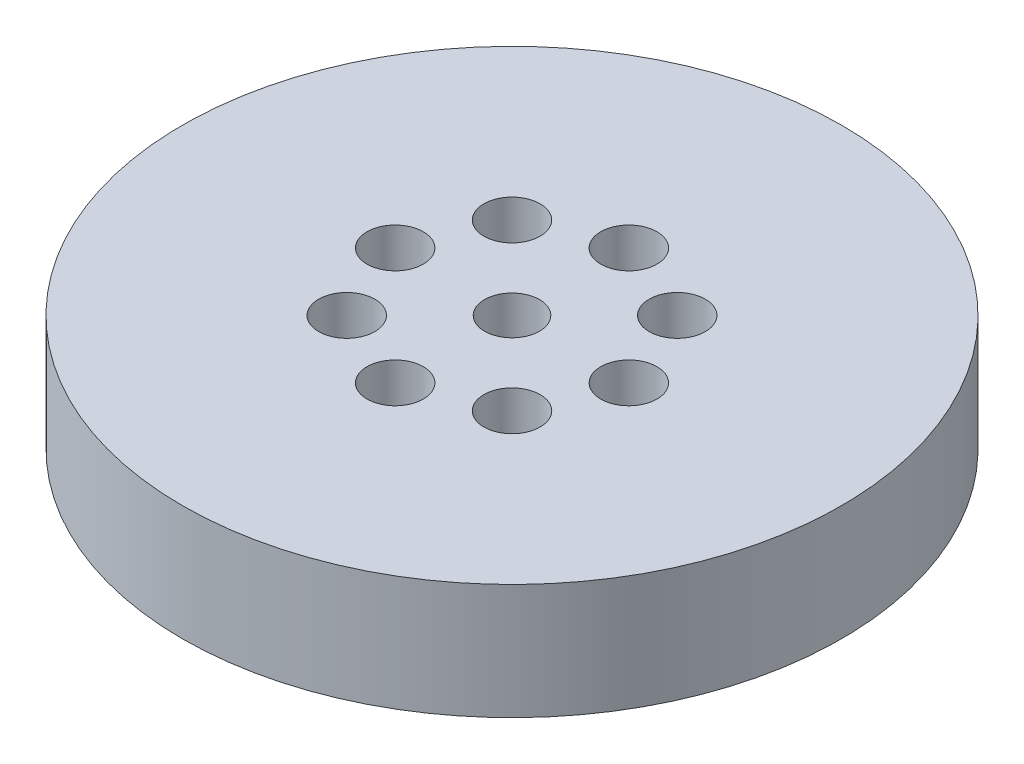
ISO-10303-21;
HEADER;
FILE_DESCRIPTION(('STEP AP214'),'2;1');
FILE_NAME('part.step','',(''),(''),'','','');
FILE_SCHEMA(('AUTOMOTIVE_DESIGN { 1 0 10303 214 1 1 1 1 }'));
ENDSEC;
DATA;
#1=APPLICATION_CONTEXT('core data for automotive mechanical design processes');
#2=APPLICATION_PROTOCOL_DEFINITION('international standard','automotive_design',2000,#1);
#3=PRODUCT_CONTEXT('',#1,'mechanical');
#4=PRODUCT('Part','Part','',(#3));
#5=PRODUCT_RELATED_PRODUCT_CATEGORY('part','',(#4));
#6=PRODUCT_DEFINITION_FORMATION('','',#4);
#7=PRODUCT_DEFINITION_CONTEXT('part definition',#1,'design');
#8=PRODUCT_DEFINITION('design','',#6,#7);
#9=PRODUCT_DEFINITION_SHAPE('','',#8);
#10=(LENGTH_UNIT() NAMED_UNIT(*) SI_UNIT(.MILLI.,.METRE.));
#11=(NAMED_UNIT(*) PLANE_ANGLE_UNIT() SI_UNIT($,.RADIAN.));
#12=(NAMED_UNIT(*) SI_UNIT($,.STERADIAN.) SOLID_ANGLE_UNIT());
#13=UNCERTAINTY_MEASURE_WITH_UNIT(LENGTH_MEASURE(1.E-05),#10,'distance_accuracy_value','');
#14=(GEOMETRIC_REPRESENTATION_CONTEXT(3) GLOBAL_UNCERTAINTY_ASSIGNED_CONTEXT((#13)) GLOBAL_UNIT_ASSIGNED_CONTEXT((#10,
#11,#12)) REPRESENTATION_CONTEXT('',''));
#15=CARTESIAN_POINT('',(0.,0.,0.));
#16=DIRECTION('',(0.,0.,1.));
#17=DIRECTION('',(1.,0.,0.));
#18=AXIS2_PLACEMENT_3D('',#15,#16,#17);
#19=CARTESIAN_POINT('',(0.,21.,0.));
#20=DIRECTION('',(0.,-1.,0.));
#21=DIRECTION('',(0.,0.,-1.));
#22=AXIS2_PLACEMENT_3D('',#19,#20,#21);
#23=CYLINDRICAL_SURFACE('',#22,60.);
#24=CARTESIAN_POINT('',(0.,21.,0.));
#25=DIRECTION('',(0.,1.,0.));
#26=DIRECTION('',(0.,0.,1.));
#27=AXIS2_PLACEMENT_3D('',#24,#25,#26);
#28=CIRCLE('',#27,60.);
#29=CARTESIAN_POINT('',(0.,21.,-60.));
#30=VERTEX_POINT('',#29);
#31=EDGE_CURVE('E10',#30,#30,#28,.T.);
#32=CARTESIAN_POINT('',(0.,0.,0.));
#33=DIRECTION('',(0.,1.,0.));
#34=DIRECTION('',(0.,0.,1.));
#35=AXIS2_PLACEMENT_3D('',#32,#33,#34);
#36=CIRCLE('',#35,60.);
#37=CARTESIAN_POINT('',(0.,0.,-60.));
#38=VERTEX_POINT('',#37);
#39=EDGE_CURVE('E37',#38,#38,#36,.T.);
#40=CARTESIAN_POINT('',(0.,21.,-60.));
#41=CARTESIAN_POINT('',(0.,20.78125,-60.));
#42=CARTESIAN_POINT('',(0.,20.5625,-60.));
#43=CARTESIAN_POINT('',(0.,20.125,-60.));
#44=CARTESIAN_POINT('',(0.,19.90625,-60.));
#45=CARTESIAN_POINT('',(0.,19.46875,-60.));
#46=CARTESIAN_POINT('',(0.,19.25,-60.));
#47=CARTESIAN_POINT('',(0.,18.8125,-60.));
#48=CARTESIAN_POINT('',(0.,18.59375,-60.));
#49=CARTESIAN_POINT('',(0.,18.15625,-60.));
#50=CARTESIAN_POINT('',(0.,17.9375,-60.));
#51=CARTESIAN_POINT('',(0.,17.5,-60.));
#52=CARTESIAN_POINT('',(0.,17.28125,-60.));
#53=CARTESIAN_POINT('',(0.,16.84375,-60.));
#54=CARTESIAN_POINT('',(0.,16.625,-60.));
#55=CARTESIAN_POINT('',(0.,16.1875,-60.));
#56=CARTESIAN_POINT('',(0.,15.96875,-60.));
#57=CARTESIAN_POINT('',(0.,15.53125,-60.));
#58=CARTESIAN_POINT('',(0.,15.3125,-60.));
#59=CARTESIAN_POINT('',(0.,14.875,-60.));
#60=CARTESIAN_POINT('',(0.,14.65625,-60.));
#61=CARTESIAN_POINT('',(0.,14.21875,-60.));
#62=CARTESIAN_POINT('',(0.,14.,-60.));
#63=CARTESIAN_POINT('',(0.,13.5625,-60.));
#64=CARTESIAN_POINT('',(0.,13.34375,-60.));
#65=CARTESIAN_POINT('',(0.,12.90625,-60.));
#66=CARTESIAN_POINT('',(0.,12.6875,-60.));
#67=CARTESIAN_POINT('',(0.,12.25,-60.));
#68=CARTESIAN_POINT('',(0.,12.03125,-60.));
#69=CARTESIAN_POINT('',(0.,11.59375,-60.));
#70=CARTESIAN_POINT('',(0.,11.375,-60.));
#71=CARTESIAN_POINT('',(0.,10.9375,-60.));
#72=CARTESIAN_POINT('',(0.,10.71875,-60.));
#73=CARTESIAN_POINT('',(0.,10.28125,-60.));
#74=CARTESIAN_POINT('',(0.,10.0625,-60.));
#75=CARTESIAN_POINT('',(0.,9.625,-60.));
#76=CARTESIAN_POINT('',(0.,9.40625,-60.));
#77=CARTESIAN_POINT('',(0.,8.96875,-60.));
#78=CARTESIAN_POINT('',(0.,8.75,-60.));
#79=CARTESIAN_POINT('',(0.,8.3125,-60.));
#80=CARTESIAN_POINT('',(0.,8.09375,-60.));
#81=CARTESIAN_POINT('',(0.,7.65625,-60.));
#82=CARTESIAN_POINT('',(0.,7.4375,-60.));
#83=CARTESIAN_POINT('',(0.,7.,-60.));
#84=CARTESIAN_POINT('',(0.,6.78125,-60.));
#85=CARTESIAN_POINT('',(0.,6.34375,-60.));
#86=CARTESIAN_POINT('',(0.,6.125,-60.));
#87=CARTESIAN_POINT('',(0.,5.6875,-60.));
#88=CARTESIAN_POINT('',(0.,5.46875,-60.));
#89=CARTESIAN_POINT('',(0.,5.03125,-60.));
#90=CARTESIAN_POINT('',(0.,4.8125,-60.));
#91=CARTESIAN_POINT('',(0.,4.375,-60.));
#92=CARTESIAN_POINT('',(0.,4.15625,-60.));
#93=CARTESIAN_POINT('',(0.,3.71875,-60.));
#94=CARTESIAN_POINT('',(0.,3.5,-60.));
#95=CARTESIAN_POINT('',(0.,3.0625,-60.));
#96=CARTESIAN_POINT('',(0.,2.84375,-60.));
#97=CARTESIAN_POINT('',(0.,2.40625,-60.));
#98=CARTESIAN_POINT('',(0.,2.1875,-60.));
#99=CARTESIAN_POINT('',(0.,1.75,-60.));
#100=CARTESIAN_POINT('',(0.,1.53125,-60.));
#101=CARTESIAN_POINT('',(0.,1.09375,-60.));
#102=CARTESIAN_POINT('',(0.,0.875000000000001,-60.));
#103=CARTESIAN_POINT('',(0.,0.4375,-60.));
#104=CARTESIAN_POINT('',(0.,0.21875,-60.));
#105=CARTESIAN_POINT('',(0.,0.,-60.));
#106=B_SPLINE_CURVE_WITH_KNOTS('',3,(#40,#41,#42,#43,#44,#45,#46,#47,#48,#49,#50,#51,#52,#53,
#54,#55,#56,#57,#58,#59,#60,#61,#62,#63,#64,#65,#66,#67,#68,#69,#70,#71,#72,#73,#74,#75,#76,#77,
#78,#79,#80,#81,#82,#83,#84,#85,#86,#87,#88,#89,#90,#91,#92,#93,#94,#95,#96,#97,#98,#99,#100,
#101,#102,#103,#104,#105),.UNSPECIFIED.,.F.,.F.,(4,2,2,2,2,2,2,2,2,2,2,2,2,2,2,2,2,2,2,2,2,2,2,
2,2,2,2,2,2,2,2,2,4),(0.,0.656250000000001,1.3125,1.96875,2.625,3.28125,3.9375,4.59375,5.25,
5.90625,6.5625,7.21875,7.875,8.53125,9.1875,9.84375,10.5,11.15625,11.8125,12.46875,13.125,
13.78125,14.4375,15.09375,15.75,16.40625,17.0625,17.71875,18.375,19.03125,19.6875,20.34375,21.),.UNSPECIFIED.);
#107=EDGE_CURVE('BSEAM40',#30,#38,#106,.T.);
#108=ORIENTED_EDGE('',*,*,#31,.F.);
#109=ORIENTED_EDGE('',*,*,#39,.T.);
#110=ORIENTED_EDGE('',*,*,#107,.T.);
#111=ORIENTED_EDGE('',*,*,#107,.F.);
#112=EDGE_LOOP('',(#108,#110,#109,#111));
#113=FACE_BOUND('',#112,.T.);
#114=ADVANCED_FACE('F40',(#113),#23,.T.);
#115=CARTESIAN_POINT('',(0.,21.,0.));
#116=DIRECTION('',(0.,1.,0.));
#117=DIRECTION('',(0.,0.,1.));
#118=AXIS2_PLACEMENT_3D('',#115,#116,#117);
#119=PLANE('',#118);
#120=CARTESIAN_POINT('',(0.,21.,21.2727506876326));
#121=DIRECTION('',(0.,1.,0.));
#122=DIRECTION('',(1.,0.,0.));
#123=AXIS2_PLACEMENT_3D('',#120,#121,#122);
#124=CIRCLE('',#123,5.11864766276758);
#125=CARTESIAN_POINT('',(5.11864766276766,21.,21.2727506876325));
#126=VERTEX_POINT('',#125);
#127=EDGE_CURVE('E88',#126,#126,#124,.T.);
#128=ORIENTED_EDGE('',*,*,#127,.F.);
#129=EDGE_LOOP('',(#128));
#130=FACE_BOUND('',#129,.T.);
#131=CARTESIAN_POINT('',(15.0421062657159,21.,15.0421062657157));
#132=DIRECTION('',(0.,1.,0.));
#133=DIRECTION('',(0.707106781186544,0.,-0.707106781186551));
#134=AXIS2_PLACEMENT_3D('',#131,#132,#133);
#135=CIRCLE('',#134,5.11864766276758);
#136=CARTESIAN_POINT('',(18.6615367385635,21.,11.422675792868));
#137=VERTEX_POINT('',#136);
#138=EDGE_CURVE('E79',#137,#137,#135,.T.);
#139=ORIENTED_EDGE('',*,*,#138,.F.);
#140=EDGE_LOOP('',(#139));
#141=FACE_BOUND('',#140,.T.);
#142=CARTESIAN_POINT('',(21.2727506876326,21.,0.));
#143=DIRECTION('',(0.,1.,0.));
#144=DIRECTION('',(0.,0.,-1.));
#145=AXIS2_PLACEMENT_3D('',#142,#143,#144);
#146=CIRCLE('',#145,5.11864766276758);
#147=CARTESIAN_POINT('',(21.2727506876326,21.,-5.11864766276758));
#148=VERTEX_POINT('',#147);
#149=EDGE_CURVE('E74',#148,#148,#146,.T.);
#150=ORIENTED_EDGE('',*,*,#149,.F.);
#151=EDGE_LOOP('',(#150));
#152=FACE_BOUND('',#151,.T.);
#153=CARTESIAN_POINT('',(15.0421062657156,21.,-15.0421062657159));
#154=DIRECTION('',(0.,1.,0.));
#155=DIRECTION('',(-0.707106781186554,0.,-0.707106781186541));
#156=AXIS2_PLACEMENT_3D('',#153,#154,#155);
#157=CIRCLE('',#156,5.11864766276758);
#158=CARTESIAN_POINT('',(11.422675792868,21.,-18.6615367385635));
#159=VERTEX_POINT('',#158);
#160=EDGE_CURVE('E70',#159,#159,#157,.T.);
#161=ORIENTED_EDGE('',*,*,#160,.F.);
#162=EDGE_LOOP('',(#161));
#163=FACE_BOUND('',#162,.T.);
#164=CARTESIAN_POINT('',(-2.22820236155195E-13,21.,-21.2727506876326));
#165=DIRECTION('',(0.,1.,0.));
#166=DIRECTION('',(-1.,0.,0.));
#167=AXIS2_PLACEMENT_3D('',#164,#165,#166);
#168=CIRCLE('',#167,5.11864766276758);
#169=CARTESIAN_POINT('',(-5.11864766276781,21.,-21.2727506876325));
#170=VERTEX_POINT('',#169);
#171=EDGE_CURVE('E100',#170,#170,#168,.T.);
#172=ORIENTED_EDGE('',*,*,#171,.F.);
#173=EDGE_LOOP('',(#172));
#174=FACE_BOUND('',#173,.T.);
#175=CARTESIAN_POINT('',(-15.042106265716,21.,-15.0421062657156));
#176=DIRECTION('',(0.,1.,0.));
#177=DIRECTION('',(-0.707106781186539,0.,0.707106781186556));
#178=AXIS2_PLACEMENT_3D('',#175,#176,#177);
#179=CIRCLE('',#178,5.11864766276758);
#180=CARTESIAN_POINT('',(-18.6615367385635,21.,-11.4226757928679));
#181=VERTEX_POINT('',#180);
#182=EDGE_CURVE('E93',#181,#181,#179,.T.);
#183=ORIENTED_EDGE('',*,*,#182,.F.);
#184=EDGE_LOOP('',(#183));
#185=FACE_BOUND('',#184,.T.);
#186=CARTESIAN_POINT('',(-15.0421062657158,21.,15.0421062657158));
#187=DIRECTION('',(0.,1.,0.));
#188=DIRECTION('',(0.707106781186549,0.,0.707106781186546));
#189=AXIS2_PLACEMENT_3D('',#186,#187,#188);
#190=CIRCLE('',#189,5.11864766276758);
#191=CARTESIAN_POINT('',(-11.4226757928681,21.,18.6615367385634));
#192=VERTEX_POINT('',#191);
#193=EDGE_CURVE('E61',#192,#192,#190,.T.);
#194=ORIENTED_EDGE('',*,*,#193,.F.);
#195=EDGE_LOOP('',(#194));
#196=FACE_BOUND('',#195,.T.);
#197=CARTESIAN_POINT('',(-21.2727506876326,21.,0.));
#198=DIRECTION('',(0.,1.,0.));
#199=DIRECTION('',(0.,0.,1.));
#200=AXIS2_PLACEMENT_3D('',#197,#198,#199);
#201=CIRCLE('',#200,5.11864766276758);
#202=CARTESIAN_POINT('',(-21.2727506876326,21.,5.11864766276758));
#203=VERTEX_POINT('',#202);
#204=EDGE_CURVE('E54',#203,#203,#201,.T.);
#205=ORIENTED_EDGE('',*,*,#204,.F.);
#206=EDGE_LOOP('',(#205));
#207=FACE_BOUND('',#206,.T.);
#208=CARTESIAN_POINT('',(0.,21.,0.));
#209=DIRECTION('',(0.,1.,0.));
#210=DIRECTION('',(0.,0.,1.));
#211=AXIS2_PLACEMENT_3D('',#208,#209,#210);
#212=CIRCLE('',#211,5.);
#213=CARTESIAN_POINT('',(0.,21.,-5.));
#214=VERTEX_POINT('',#213);
#215=EDGE_CURVE('E50',#214,#214,#212,.T.);
#216=ORIENTED_EDGE('',*,*,#215,.F.);
#217=EDGE_LOOP('',(#216));
#218=FACE_BOUND('',#217,.T.);
#219=ORIENTED_EDGE('',*,*,#31,.T.);
#220=EDGE_LOOP('',(#219));
#221=FACE_BOUND('',#220,.T.);
#222=ADVANCED_FACE('F115',(#130,#141,#152,#163,#174,#185,#196,#207,#218,#221),#119,.T.);
#223=CARTESIAN_POINT('',(0.,0.,0.));
#224=DIRECTION('',(0.,1.,0.));
#225=DIRECTION('',(0.,0.,1.));
#226=AXIS2_PLACEMENT_3D('',#223,#224,#225);
#227=PLANE('',#226);
#228=CARTESIAN_POINT('',(0.,0.,0.));
#229=DIRECTION('',(0.,1.,0.));
#230=DIRECTION('',(0.,0.,1.));
#231=AXIS2_PLACEMENT_3D('',#228,#229,#230);
#232=CIRCLE('',#231,5.);
#233=CARTESIAN_POINT('',(0.,0.,-5.));
#234=VERTEX_POINT('',#233);
#235=EDGE_CURVE('E47',#234,#234,#232,.T.);
#236=ORIENTED_EDGE('',*,*,#235,.T.);
#237=EDGE_LOOP('',(#236));
#238=FACE_BOUND('',#237,.T.);
#239=ORIENTED_EDGE('',*,*,#39,.F.);
#240=EDGE_LOOP('',(#239));
#241=FACE_BOUND('',#240,.T.);
#242=ADVANCED_FACE('F113',(#238,#241),#227,.F.);
#243=CARTESIAN_POINT('',(0.,21.,0.));
#244=DIRECTION('',(0.,-1.,0.));
#245=DIRECTION('',(0.,0.,-1.));
#246=AXIS2_PLACEMENT_3D('',#243,#244,#245);
#247=CYLINDRICAL_SURFACE('',#246,5.);
#248=CARTESIAN_POINT('',(0.,21.,-5.));
#249=CARTESIAN_POINT('',(0.,20.78125,-5.));
#250=CARTESIAN_POINT('',(0.,20.5625,-5.));
#251=CARTESIAN_POINT('',(0.,20.125,-5.));
#252=CARTESIAN_POINT('',(0.,19.90625,-5.));
#253=CARTESIAN_POINT('',(0.,19.46875,-5.));
#254=CARTESIAN_POINT('',(0.,19.25,-5.));
#255=CARTESIAN_POINT('',(0.,18.8125,-5.));
#256=CARTESIAN_POINT('',(0.,18.59375,-5.));
#257=CARTESIAN_POINT('',(0.,18.15625,-5.));
#258=CARTESIAN_POINT('',(0.,17.9375,-5.));
#259=CARTESIAN_POINT('',(0.,17.5,-5.));
#260=CARTESIAN_POINT('',(0.,17.28125,-5.));
#261=CARTESIAN_POINT('',(0.,16.84375,-5.));
#262=CARTESIAN_POINT('',(0.,16.625,-5.));
#263=CARTESIAN_POINT('',(0.,16.1875,-5.));
#264=CARTESIAN_POINT('',(0.,15.96875,-5.));
#265=CARTESIAN_POINT('',(0.,15.53125,-5.));
#266=CARTESIAN_POINT('',(0.,15.3125,-5.));
#267=CARTESIAN_POINT('',(0.,14.875,-5.));
#268=CARTESIAN_POINT('',(0.,14.65625,-5.));
#269=CARTESIAN_POINT('',(0.,14.21875,-5.));
#270=CARTESIAN_POINT('',(0.,14.,-5.));
#271=CARTESIAN_POINT('',(0.,13.5625,-5.));
#272=CARTESIAN_POINT('',(0.,13.34375,-5.));
#273=CARTESIAN_POINT('',(0.,12.90625,-5.));
#274=CARTESIAN_POINT('',(0.,12.6875,-5.));
#275=CARTESIAN_POINT('',(0.,12.25,-5.));
#276=CARTESIAN_POINT('',(0.,12.03125,-5.));
#277=CARTESIAN_POINT('',(0.,11.59375,-5.));
#278=CARTESIAN_POINT('',(0.,11.375,-5.));
#279=CARTESIAN_POINT('',(0.,10.9375,-5.));
#280=CARTESIAN_POINT('',(0.,10.71875,-5.));
#281=CARTESIAN_POINT('',(0.,10.28125,-5.));
#282=CARTESIAN_POINT('',(0.,10.0625,-5.));
#283=CARTESIAN_POINT('',(0.,9.625,-5.));
#284=CARTESIAN_POINT('',(0.,9.40625,-5.));
#285=CARTESIAN_POINT('',(0.,8.96875,-5.));
#286=CARTESIAN_POINT('',(0.,8.75,-5.));
#287=CARTESIAN_POINT('',(0.,8.3125,-5.));
#288=CARTESIAN_POINT('',(0.,8.09375,-5.));
#289=CARTESIAN_POINT('',(0.,7.65625,-5.));
#290=CARTESIAN_POINT('',(0.,7.4375,-5.));
#291=CARTESIAN_POINT('',(0.,7.,-5.));
#292=CARTESIAN_POINT('',(0.,6.78125,-5.));
#293=CARTESIAN_POINT('',(0.,6.34375,-5.));
#294=CARTESIAN_POINT('',(0.,6.125,-5.));
#295=CARTESIAN_POINT('',(0.,5.6875,-5.));
#296=CARTESIAN_POINT('',(0.,5.46875,-5.));
#297=CARTESIAN_POINT('',(0.,5.03125,-5.));
#298=CARTESIAN_POINT('',(0.,4.8125,-5.));
#299=CARTESIAN_POINT('',(0.,4.375,-5.));
#300=CARTESIAN_POINT('',(0.,4.15625,-5.));
#301=CARTESIAN_POINT('',(0.,3.71875,-5.));
#302=CARTESIAN_POINT('',(0.,3.5,-5.));
#303=CARTESIAN_POINT('',(0.,3.0625,-5.));
#304=CARTESIAN_POINT('',(0.,2.84375,-5.));
#305=CARTESIAN_POINT('',(0.,2.40625,-5.));
#306=CARTESIAN_POINT('',(0.,2.1875,-5.));
#307=CARTESIAN_POINT('',(0.,1.75,-5.));
#308=CARTESIAN_POINT('',(0.,1.53125,-5.));
#309=CARTESIAN_POINT('',(0.,1.09375,-5.));
#310=CARTESIAN_POINT('',(0.,0.875000000000001,-5.));
#311=CARTESIAN_POINT('',(0.,0.4375,-5.));
#312=CARTESIAN_POINT('',(0.,0.21875,-5.));
#313=CARTESIAN_POINT('',(0.,0.,-5.));
#314=B_SPLINE_CURVE_WITH_KNOTS('',3,(#248,#249,#250,#251,#252,#253,#254,#255,#256,#257,#258,
#259,#260,#261,#262,#263,#264,#265,#266,#267,#268,#269,#270,#271,#272,#273,#274,#275,#276,#277,
#278,#279,#280,#281,#282,#283,#284,#285,#286,#287,#288,#289,#290,#291,#292,#293,#294,#295,#296,
#297,#298,#299,#300,#301,#302,#303,#304,#305,#306,#307,#308,#309,#310,#311,#312,#313),
.UNSPECIFIED.,.F.,.F.,(4,2,2,2,2,2,2,2,2,2,2,2,2,2,2,2,2,2,2,2,2,2,2,2,2,2,2,2,2,2,2,2,4),(0.,
0.656250000000001,1.3125,1.96875,2.625,3.28125,3.9375,4.59375,5.25,5.90625,6.5625,7.21875,7.875,
8.53125,9.1875,9.84375,10.5,11.15625,11.8125,12.46875,13.125,13.78125,14.4375,15.09375,15.75,
16.40625,17.0625,17.71875,18.375,19.03125,19.6875,20.34375,21.),.UNSPECIFIED.);
#315=EDGE_CURVE('BSEAM127',#214,#234,#314,.T.);
#316=ORIENTED_EDGE('',*,*,#215,.T.);
#317=ORIENTED_EDGE('',*,*,#235,.F.);
#318=ORIENTED_EDGE('',*,*,#315,.T.);
#319=ORIENTED_EDGE('',*,*,#315,.F.);
#320=EDGE_LOOP('',(#316,#318,#317,#319));
#321=FACE_BOUND('',#320,.T.);
#322=ADVANCED_FACE('F127',(#321),#247,.F.);
#323=CARTESIAN_POINT('',(-21.2727506876326,2.29104146217999,0.));
#324=DIRECTION('',(0.,1.,0.));
#325=DIRECTION('',(0.,0.,1.));
#326=AXIS2_PLACEMENT_3D('',#323,#324,#325);
#327=CYLINDRICAL_SURFACE('',#326,5.11864766276758);
#328=CARTESIAN_POINT('',(-21.2727506876326,2.29104146217999,0.));
#329=DIRECTION('',(0.,1.,0.));
#330=DIRECTION('',(0.,0.,1.));
#331=AXIS2_PLACEMENT_3D('',#328,#329,#330);
#332=CIRCLE('',#331,5.11864766276758);
#333=CARTESIAN_POINT('',(-21.2727506876326,2.29104146217999,5.11864766276758));
#334=VERTEX_POINT('',#333);
#335=EDGE_CURVE('E55',#334,#334,#332,.T.);
#336=ORIENTED_EDGE('',*,*,#335,.F.);
#337=EDGE_LOOP('',(#336));
#338=FACE_BOUND('',#337,.T.);
#339=ORIENTED_EDGE('',*,*,#204,.T.);
#340=EDGE_LOOP('',(#339));
#341=FACE_BOUND('',#340,.T.);
#342=ADVANCED_FACE('F129',(#338,#341),#327,.F.);
#343=CARTESIAN_POINT('',(-21.2727506876326,2.29104146217999,0.));
#344=DIRECTION('',(0.,1.,0.));
#345=DIRECTION('',(0.,0.,1.));
#346=AXIS2_PLACEMENT_3D('',#343,#344,#345);
#347=PLANE('',#346);
#348=ORIENTED_EDGE('',*,*,#335,.T.);
#349=EDGE_LOOP('',(#348));
#350=FACE_BOUND('',#349,.T.);
#351=ADVANCED_FACE('F157',(#350),#347,.T.);
#352=CARTESIAN_POINT('',(-15.0421062657158,2.29104146217999,15.0421062657158));
#353=DIRECTION('',(0.,1.,0.));
#354=DIRECTION('',(0.,0.,1.));
#355=AXIS2_PLACEMENT_3D('',#352,#353,#354);
#356=CYLINDRICAL_SURFACE('',#355,5.11864766276758);
#357=CARTESIAN_POINT('',(-15.0421062657158,2.29104146217999,15.0421062657158));
#358=DIRECTION('',(0.,1.,0.));
#359=DIRECTION('',(0.707106781186549,0.,0.707106781186546));
#360=AXIS2_PLACEMENT_3D('',#357,#358,#359);
#361=CIRCLE('',#360,5.11864766276758);
#362=CARTESIAN_POINT('',(-11.4226757928681,2.29104146217999,18.6615367385634));
#363=VERTEX_POINT('',#362);
#364=EDGE_CURVE('E59',#363,#363,#361,.T.);
#365=ORIENTED_EDGE('',*,*,#364,.F.);
#366=EDGE_LOOP('',(#365));
#367=FACE_BOUND('',#366,.T.);
#368=ORIENTED_EDGE('',*,*,#193,.T.);
#369=EDGE_LOOP('',(#368));
#370=FACE_BOUND('',#369,.T.);
#371=ADVANCED_FACE('F170',(#367,#370),#356,.F.);
#372=CARTESIAN_POINT('',(-15.0421062657158,2.29104146217999,15.0421062657158));
#373=DIRECTION('',(0.,1.,0.));
#374=DIRECTION('',(0.707106781186549,0.,0.707106781186546));
#375=AXIS2_PLACEMENT_3D('',#372,#373,#374);
#376=PLANE('',#375);
#377=ORIENTED_EDGE('',*,*,#364,.T.);
#378=EDGE_LOOP('',(#377));
#379=FACE_BOUND('',#378,.T.);
#380=ADVANCED_FACE('F182',(#379),#376,.T.);
#381=CARTESIAN_POINT('',(-15.042106265716,2.29104146217999,-15.0421062657156));
#382=DIRECTION('',(0.,1.,0.));
#383=DIRECTION('',(0.,0.,1.));
#384=AXIS2_PLACEMENT_3D('',#381,#382,#383);
#385=CYLINDRICAL_SURFACE('',#384,5.11864766276758);
#386=CARTESIAN_POINT('',(-15.042106265716,2.29104146217999,-15.0421062657156));
#387=DIRECTION('',(0.,1.,0.));
#388=DIRECTION('',(-0.707106781186539,0.,0.707106781186556));
#389=AXIS2_PLACEMENT_3D('',#386,#387,#388);
#390=CIRCLE('',#389,5.11864766276758);
#391=CARTESIAN_POINT('',(-18.6615367385635,2.29104146217999,-11.4226757928679));
#392=VERTEX_POINT('',#391);
#393=EDGE_CURVE('E94',#392,#392,#390,.T.);
#394=ORIENTED_EDGE('',*,*,#393,.F.);
#395=EDGE_LOOP('',(#394));
#396=FACE_BOUND('',#395,.T.);
#397=ORIENTED_EDGE('',*,*,#182,.T.);
#398=EDGE_LOOP('',(#397));
#399=FACE_BOUND('',#398,.T.);
#400=ADVANCED_FACE('F189',(#396,#399),#385,.F.);
#401=CARTESIAN_POINT('',(-15.042106265716,2.29104146217999,-15.0421062657156));
#402=DIRECTION('',(0.,1.,0.));
#403=DIRECTION('',(-0.707106781186539,0.,0.707106781186556));
#404=AXIS2_PLACEMENT_3D('',#401,#402,#403);
#405=PLANE('',#404);
#406=ORIENTED_EDGE('',*,*,#393,.T.);
#407=EDGE_LOOP('',(#406));
#408=FACE_BOUND('',#407,.T.);
#409=ADVANCED_FACE('F107',(#408),#405,.T.);
#410=CARTESIAN_POINT('',(-2.22820236155195E-13,2.29104146217999,-21.2727506876326));
#411=DIRECTION('',(0.,1.,0.));
#412=DIRECTION('',(0.,0.,1.));
#413=AXIS2_PLACEMENT_3D('',#410,#411,#412);
#414=CYLINDRICAL_SURFACE('',#413,5.11864766276758);
#415=CARTESIAN_POINT('',(-2.22820236155195E-13,2.29104146217999,-21.2727506876326));
#416=DIRECTION('',(0.,1.,0.));
#417=DIRECTION('',(-1.,0.,0.));
#418=AXIS2_PLACEMENT_3D('',#415,#416,#417);
#419=CIRCLE('',#418,5.11864766276758);
#420=CARTESIAN_POINT('',(-5.11864766276781,2.29104146217999,-21.2727506876325));
#421=VERTEX_POINT('',#420);
#422=EDGE_CURVE('E72',#421,#421,#419,.T.);
#423=ORIENTED_EDGE('',*,*,#422,.F.);
#424=EDGE_LOOP('',(#423));
#425=FACE_BOUND('',#424,.T.);
#426=ORIENTED_EDGE('',*,*,#171,.T.);
#427=EDGE_LOOP('',(#426));
#428=FACE_BOUND('',#427,.T.);
#429=ADVANCED_FACE('F104',(#425,#428),#414,.F.);
#430=CARTESIAN_POINT('',(-2.22820236155195E-13,2.29104146217999,-21.2727506876326));
#431=DIRECTION('',(0.,1.,0.));
#432=DIRECTION('',(-1.,0.,0.));
#433=AXIS2_PLACEMENT_3D('',#430,#431,#432);
#434=PLANE('',#433);
#435=ORIENTED_EDGE('',*,*,#422,.T.);
#436=EDGE_LOOP('',(#435));
#437=FACE_BOUND('',#436,.T.);
#438=ADVANCED_FACE('F103',(#437),#434,.T.);
#439=CARTESIAN_POINT('',(15.0421062657156,2.29104146217999,-15.0421062657159));
#440=DIRECTION('',(0.,1.,0.));
#441=DIRECTION('',(0.,0.,1.));
#442=AXIS2_PLACEMENT_3D('',#439,#440,#441);
#443=CYLINDRICAL_SURFACE('',#442,5.11864766276758);
#444=CARTESIAN_POINT('',(15.0421062657156,2.29104146217999,-15.0421062657159));
#445=DIRECTION('',(0.,1.,0.));
#446=DIRECTION('',(-0.707106781186554,0.,-0.707106781186541));
#447=AXIS2_PLACEMENT_3D('',#444,#445,#446);
#448=CIRCLE('',#447,5.11864766276758);
#449=CARTESIAN_POINT('',(11.422675792868,2.29104146217999,-18.6615367385635));
#450=VERTEX_POINT('',#449);
#451=EDGE_CURVE('E69',#450,#450,#448,.T.);
#452=ORIENTED_EDGE('',*,*,#451,.F.);
#453=EDGE_LOOP('',(#452));
#454=FACE_BOUND('',#453,.T.);
#455=ORIENTED_EDGE('',*,*,#160,.T.);
#456=EDGE_LOOP('',(#455));
#457=FACE_BOUND('',#456,.T.);
#458=ADVANCED_FACE('F219',(#454,#457),#443,.F.);
#459=CARTESIAN_POINT('',(15.0421062657156,2.29104146217999,-15.0421062657159));
#460=DIRECTION('',(0.,1.,0.));
#461=DIRECTION('',(-0.707106781186554,0.,-0.707106781186541));
#462=AXIS2_PLACEMENT_3D('',#459,#460,#461);
#463=PLANE('',#462);
#464=ORIENTED_EDGE('',*,*,#451,.T.);
#465=EDGE_LOOP('',(#464));
#466=FACE_BOUND('',#465,.T.);
#467=ADVANCED_FACE('F227',(#466),#463,.T.);
#468=CARTESIAN_POINT('',(21.2727506876326,2.29104146217999,0.));
#469=DIRECTION('',(0.,1.,0.));
#470=DIRECTION('',(0.,0.,1.));
#471=AXIS2_PLACEMENT_3D('',#468,#469,#470);
#472=CYLINDRICAL_SURFACE('',#471,5.11864766276758);
#473=CARTESIAN_POINT('',(21.2727506876326,2.29104146217999,0.));
#474=DIRECTION('',(0.,1.,0.));
#475=DIRECTION('',(0.,0.,-1.));
#476=AXIS2_PLACEMENT_3D('',#473,#474,#475);
#477=CIRCLE('',#476,5.11864766276758);
#478=CARTESIAN_POINT('',(21.2727506876326,2.29104146217999,-5.11864766276758));
#479=VERTEX_POINT('',#478);
#480=EDGE_CURVE('E80',#479,#479,#477,.T.);
#481=ORIENTED_EDGE('',*,*,#480,.F.);
#482=EDGE_LOOP('',(#481));
#483=FACE_BOUND('',#482,.T.);
#484=ORIENTED_EDGE('',*,*,#149,.T.);
#485=EDGE_LOOP('',(#484));
#486=FACE_BOUND('',#485,.T.);
#487=ADVANCED_FACE('F240',(#483,#486),#472,.F.);
#488=CARTESIAN_POINT('',(21.2727506876326,2.29104146217999,0.));
#489=DIRECTION('',(0.,1.,0.));
#490=DIRECTION('',(0.,0.,-1.));
#491=AXIS2_PLACEMENT_3D('',#488,#489,#490);
#492=PLANE('',#491);
#493=ORIENTED_EDGE('',*,*,#480,.T.);
#494=EDGE_LOOP('',(#493));
#495=FACE_BOUND('',#494,.T.);
#496=ADVANCED_FACE('F246',(#495),#492,.T.);
#497=CARTESIAN_POINT('',(15.0421062657159,2.29104146217999,15.0421062657157));
#498=DIRECTION('',(0.,1.,0.));
#499=DIRECTION('',(0.,0.,1.));
#500=AXIS2_PLACEMENT_3D('',#497,#498,#499);
#501=CYLINDRICAL_SURFACE('',#500,5.11864766276758);
#502=CARTESIAN_POINT('',(15.0421062657159,2.29104146217999,15.0421062657157));
#503=DIRECTION('',(0.,1.,0.));
#504=DIRECTION('',(0.707106781186544,0.,-0.707106781186551));
#505=AXIS2_PLACEMENT_3D('',#502,#503,#504);
#506=CIRCLE('',#505,5.11864766276758);
#507=CARTESIAN_POINT('',(18.6615367385635,2.29104146217999,11.422675792868));
#508=VERTEX_POINT('',#507);
#509=EDGE_CURVE('E82',#508,#508,#506,.T.);
#510=ORIENTED_EDGE('',*,*,#509,.F.);
#511=EDGE_LOOP('',(#510));
#512=FACE_BOUND('',#511,.T.);
#513=ORIENTED_EDGE('',*,*,#138,.T.);
#514=EDGE_LOOP('',(#513));
#515=FACE_BOUND('',#514,.T.);
#516=ADVANCED_FACE('F254',(#512,#515),#501,.F.);
#517=CARTESIAN_POINT('',(15.0421062657159,2.29104146217999,15.0421062657157));
#518=DIRECTION('',(0.,1.,0.));
#519=DIRECTION('',(0.707106781186544,0.,-0.707106781186551));
#520=AXIS2_PLACEMENT_3D('',#517,#518,#519);
#521=PLANE('',#520);
#522=ORIENTED_EDGE('',*,*,#509,.T.);
#523=EDGE_LOOP('',(#522));
#524=FACE_BOUND('',#523,.T.);
#525=ADVANCED_FACE('F262',(#524),#521,.T.);
#526=CARTESIAN_POINT('',(0.,2.29104146217999,21.2727506876326));
#527=DIRECTION('',(0.,1.,0.));
#528=DIRECTION('',(0.,0.,1.));
#529=AXIS2_PLACEMENT_3D('',#526,#527,#528);
#530=CYLINDRICAL_SURFACE('',#529,5.11864766276758);
#531=CARTESIAN_POINT('',(0.,2.29104146217999,21.2727506876326));
#532=DIRECTION('',(0.,1.,0.));
#533=DIRECTION('',(1.,0.,0.));
#534=AXIS2_PLACEMENT_3D('',#531,#532,#533);
#535=CIRCLE('',#534,5.11864766276758);
#536=CARTESIAN_POINT('',(5.11864766276766,2.29104146217999,21.2727506876325));
#537=VERTEX_POINT('',#536);
#538=EDGE_CURVE('E63',#537,#537,#535,.T.);
#539=ORIENTED_EDGE('',*,*,#538,.F.);
#540=EDGE_LOOP('',(#539));
#541=FACE_BOUND('',#540,.T.);
#542=ORIENTED_EDGE('',*,*,#127,.T.);
#543=EDGE_LOOP('',(#542));
#544=FACE_BOUND('',#543,.T.);
#545=ADVANCED_FACE('F272',(#541,#544),#530,.F.);
#546=CARTESIAN_POINT('',(0.,2.29104146217999,21.2727506876326));
#547=DIRECTION('',(0.,1.,0.));
#548=DIRECTION('',(1.,0.,0.));
#549=AXIS2_PLACEMENT_3D('',#546,#547,#548);
#550=PLANE('',#549);
#551=ORIENTED_EDGE('',*,*,#538,.T.);
#552=EDGE_LOOP('',(#551));
#553=FACE_BOUND('',#552,.T.);
#554=ADVANCED_FACE('F285',(#553),#550,.T.);
#555=CLOSED_SHELL('',(#114,#222,#242,#322,#342,#351,#371,#380,#400,#409,#429,#438,#458,#467,
#487,#496,#516,#525,#545,#554));
#556=MANIFOLD_SOLID_BREP('B2',#555);
#557=ADVANCED_BREP_SHAPE_REPRESENTATION('',(#18,#556),#14);
#558=SHAPE_DEFINITION_REPRESENTATION(#9,#557);
ENDSEC;
END-ISO-10303-21;
